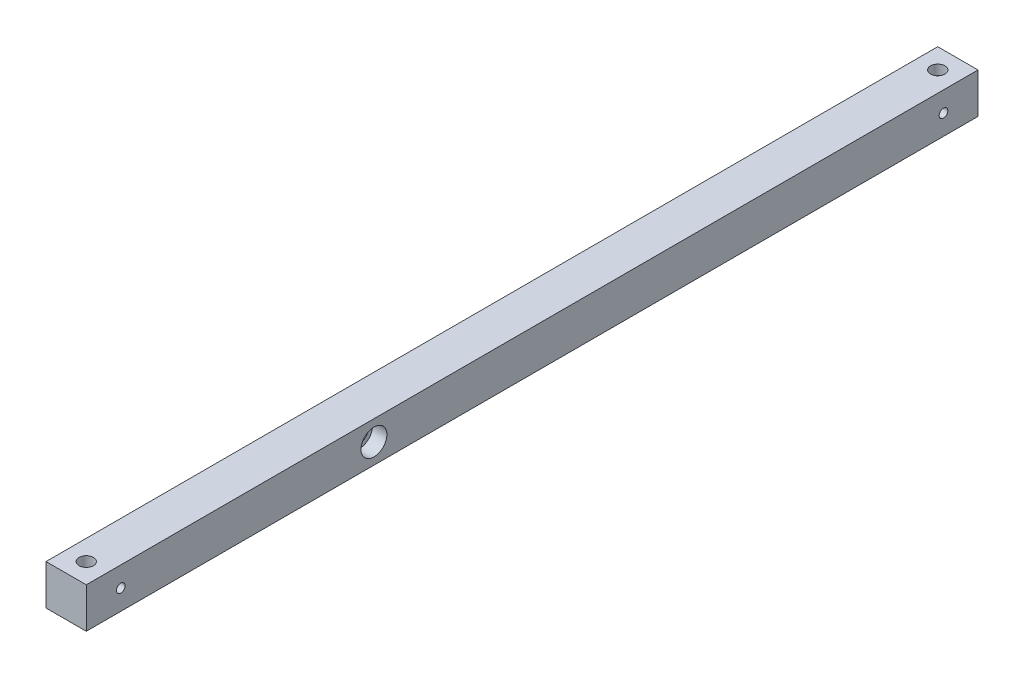
ISO-10303-21;
HEADER;
FILE_DESCRIPTION(('STEP AP214'),'2;1');
FILE_NAME('part.step','',(''),(''),'','','');
FILE_SCHEMA(('AUTOMOTIVE_DESIGN { 1 0 10303 214 1 1 1 1 }'));
ENDSEC;
DATA;
#1=APPLICATION_CONTEXT('core data for automotive mechanical design processes');
#2=APPLICATION_PROTOCOL_DEFINITION('international standard','automotive_design',2000,#1);
#3=PRODUCT_CONTEXT('',#1,'mechanical');
#4=PRODUCT('Part','Part','',(#3));
#5=PRODUCT_RELATED_PRODUCT_CATEGORY('part','',(#4));
#6=PRODUCT_DEFINITION_FORMATION('','',#4);
#7=PRODUCT_DEFINITION_CONTEXT('part definition',#1,'design');
#8=PRODUCT_DEFINITION('design','',#6,#7);
#9=PRODUCT_DEFINITION_SHAPE('','',#8);
#10=(LENGTH_UNIT() NAMED_UNIT(*) SI_UNIT(.MILLI.,.METRE.));
#11=(NAMED_UNIT(*) PLANE_ANGLE_UNIT() SI_UNIT($,.RADIAN.));
#12=(NAMED_UNIT(*) SI_UNIT($,.STERADIAN.) SOLID_ANGLE_UNIT());
#13=UNCERTAINTY_MEASURE_WITH_UNIT(LENGTH_MEASURE(1.E-05),#10,'distance_accuracy_value','');
#14=(GEOMETRIC_REPRESENTATION_CONTEXT(3) GLOBAL_UNCERTAINTY_ASSIGNED_CONTEXT((#13)) GLOBAL_UNIT_ASSIGNED_CONTEXT((#10,
#11,#12)) REPRESENTATION_CONTEXT('',''));
#15=CARTESIAN_POINT('',(0.,0.,0.));
#16=DIRECTION('',(0.,0.,1.));
#17=DIRECTION('',(1.,0.,0.));
#18=AXIS2_PLACEMENT_3D('',#15,#16,#17);
#19=CARTESIAN_POINT('',(-14.001,0.,596.));
#20=DIRECTION('',(1.,0.,0.));
#21=DIRECTION('',(0.,0.,-1.));
#22=AXIS2_PLACEMENT_3D('',#19,#20,#21);
#23=CYLINDRICAL_SURFACE('',#22,3.00000000000005);
#24=CARTESIAN_POINT('',(14.,0.,596.));
#25=DIRECTION('',(1.,0.,0.));
#26=DIRECTION('',(0.,0.,-1.));
#27=AXIS2_PLACEMENT_3D('',#24,#25,#26);
#28=CIRCLE('',#27,3.00000000000005);
#29=CARTESIAN_POINT('',(14.,0.,593.));
#30=VERTEX_POINT('',#29);
#31=EDGE_CURVE('E126',#30,#30,#28,.T.);
#32=ORIENTED_EDGE('',*,*,#31,.T.);
#33=EDGE_LOOP('',(#32));
#34=FACE_BOUND('',#33,.T.);
#35=CARTESIAN_POINT('',(-7.,0.,596.));
#36=DIRECTION('',(-1.,0.,0.));
#37=DIRECTION('',(0.,0.,1.));
#38=AXIS2_PLACEMENT_3D('',#35,#36,#37);
#39=CIRCLE('',#38,3.00000000000005);
#40=CARTESIAN_POINT('',(-7.,0.,599.));
#41=VERTEX_POINT('',#40);
#42=EDGE_CURVE('E36',#41,#41,#39,.F.);
#43=ORIENTED_EDGE('',*,*,#42,.F.);
#44=EDGE_LOOP('',(#43));
#45=FACE_BOUND('',#44,.T.);
#46=ADVANCED_FACE('F32',(#34,#45),#23,.F.);
#47=CARTESIAN_POINT('',(-14.001,0.,24.));
#48=DIRECTION('',(1.,0.,0.));
#49=DIRECTION('',(0.,0.,-1.));
#50=AXIS2_PLACEMENT_3D('',#47,#48,#49);
#51=CYLINDRICAL_SURFACE('',#50,3.);
#52=CARTESIAN_POINT('',(14.,0.,24.));
#53=DIRECTION('',(1.,0.,0.));
#54=DIRECTION('',(0.,0.,-1.));
#55=AXIS2_PLACEMENT_3D('',#52,#53,#54);
#56=CIRCLE('',#55,3.);
#57=CARTESIAN_POINT('',(14.,0.,21.));
#58=VERTEX_POINT('',#57);
#59=EDGE_CURVE('E141',#58,#58,#56,.T.);
#60=ORIENTED_EDGE('',*,*,#59,.T.);
#61=EDGE_LOOP('',(#60));
#62=FACE_BOUND('',#61,.T.);
#63=CARTESIAN_POINT('',(-7.,0.,24.));
#64=DIRECTION('',(-1.,0.,0.));
#65=DIRECTION('',(0.,0.,1.));
#66=AXIS2_PLACEMENT_3D('',#63,#64,#65);
#67=CIRCLE('',#66,3.);
#68=CARTESIAN_POINT('',(-7.,0.,27.));
#69=VERTEX_POINT('',#68);
#70=EDGE_CURVE('E120',#69,#69,#67,.F.);
#71=ORIENTED_EDGE('',*,*,#70,.F.);
#72=EDGE_LOOP('',(#71));
#73=FACE_BOUND('',#72,.T.);
#74=ADVANCED_FACE('F186',(#62,#73),#51,.F.);
#75=CARTESIAN_POINT('',(-14.,0.,420.));
#76=DIRECTION('',(1.,0.,0.));
#77=DIRECTION('',(0.,0.,-1.));
#78=AXIS2_PLACEMENT_3D('',#75,#76,#77);
#79=CYLINDRICAL_SURFACE('',#78,5.99999999999999);
#80=CARTESIAN_POINT('',(-14.,0.,420.));
#81=DIRECTION('',(1.,0.,0.));
#82=DIRECTION('',(0.,0.,-1.));
#83=AXIS2_PLACEMENT_3D('',#80,#81,#82);
#84=CIRCLE('',#83,5.99999999999999);
#85=CARTESIAN_POINT('',(-14.,0.,414.));
#86=VERTEX_POINT('',#85);
#87=EDGE_CURVE('E118',#86,#86,#84,.T.);
#88=ORIENTED_EDGE('',*,*,#87,.F.);
#89=EDGE_LOOP('',(#88));
#90=FACE_BOUND('',#89,.T.);
#91=CARTESIAN_POINT('',(4.,0.,420.));
#92=DIRECTION('',(1.,0.,0.));
#93=DIRECTION('',(0.,0.,-1.));
#94=AXIS2_PLACEMENT_3D('',#91,#92,#93);
#95=CIRCLE('',#94,5.99999999999999);
#96=CARTESIAN_POINT('',(4.,0.,414.));
#97=VERTEX_POINT('',#96);
#98=EDGE_CURVE('E116',#97,#97,#95,.F.);
#99=ORIENTED_EDGE('',*,*,#98,.F.);
#100=EDGE_LOOP('',(#99));
#101=FACE_BOUND('',#100,.T.);
#102=ADVANCED_FACE('F182',(#90,#101),#79,.F.);
#103=CARTESIAN_POINT('',(14.,-14.,620.));
#104=DIRECTION('',(-1.,0.,0.));
#105=DIRECTION('',(0.,0.,1.));
#106=AXIS2_PLACEMENT_3D('',#103,#104,#105);
#107=PLANE('',#106);
#108=ORIENTED_EDGE('',*,*,#59,.F.);
#109=EDGE_LOOP('',(#108));
#110=FACE_BOUND('',#109,.T.);
#111=ORIENTED_EDGE('',*,*,#31,.F.);
#112=EDGE_LOOP('',(#111));
#113=FACE_BOUND('',#112,.T.);
#114=CARTESIAN_POINT('',(14.,0.,420.));
#115=DIRECTION('',(1.,0.,0.));
#116=DIRECTION('',(0.,0.,-1.));
#117=AXIS2_PLACEMENT_3D('',#114,#115,#116);
#118=CIRCLE('',#117,8.99999999999998);
#119=CARTESIAN_POINT('',(14.,0.,411.));
#120=VERTEX_POINT('',#119);
#121=EDGE_CURVE('E144',#120,#120,#118,.T.);
#122=ORIENTED_EDGE('',*,*,#121,.F.);
#123=EDGE_LOOP('',(#122));
#124=FACE_BOUND('',#123,.T.);
#125=DIRECTION('',(0.,1.,0.));
#126=VECTOR('',#125,1.);
#127=CARTESIAN_POINT('',(14.,-14.,0.));
#128=LINE('',#127,#126);
#129=CARTESIAN_POINT('',(14.,-14.,0.));
#130=VERTEX_POINT('',#129);
#131=CARTESIAN_POINT('',(14.,14.,0.));
#132=VERTEX_POINT('',#131);
#133=EDGE_CURVE('E99',#130,#132,#128,.T.);
#134=ORIENTED_EDGE('',*,*,#133,.T.);
#135=DIRECTION('',(0.,0.,-1.));
#136=VECTOR('',#135,1.);
#137=CARTESIAN_POINT('',(14.,14.,620.));
#138=LINE('',#137,#136);
#139=CARTESIAN_POINT('',(14.,14.,620.));
#140=VERTEX_POINT('',#139);
#141=EDGE_CURVE('E11',#140,#132,#138,.T.);
#142=ORIENTED_EDGE('',*,*,#141,.F.);
#143=DIRECTION('',(0.,1.,0.));
#144=VECTOR('',#143,1.);
#145=CARTESIAN_POINT('',(14.,-14.,620.));
#146=LINE('',#145,#144);
#147=CARTESIAN_POINT('',(14.,-14.,620.));
#148=VERTEX_POINT('',#147);
#149=EDGE_CURVE('E86',#148,#140,#146,.T.);
#150=ORIENTED_EDGE('',*,*,#149,.F.);
#151=DIRECTION('',(0.,0.,-1.));
#152=VECTOR('',#151,1.);
#153=CARTESIAN_POINT('',(14.,-14.,620.));
#154=LINE('',#153,#152);
#155=EDGE_CURVE('E95',#148,#130,#154,.T.);
#156=ORIENTED_EDGE('',*,*,#155,.T.);
#157=EDGE_LOOP('',(#134,#142,#150,#156));
#158=FACE_BOUND('',#157,.T.);
#159=ADVANCED_FACE('F34',(#110,#113,#124,#158),#107,.F.);
#160=CARTESIAN_POINT('',(-14.,14.,620.));
#161=DIRECTION('',(0.,-1.,0.));
#162=DIRECTION('',(0.,0.,-1.));
#163=AXIS2_PLACEMENT_3D('',#160,#161,#162);
#164=PLANE('',#163);
#165=CARTESIAN_POINT('',(0.,14.,14.));
#166=DIRECTION('',(0.,1.,0.));
#167=DIRECTION('',(0.,0.,1.));
#168=AXIS2_PLACEMENT_3D('',#165,#166,#167);
#169=CIRCLE('',#168,5.);
#170=CARTESIAN_POINT('',(0.,14.,19.));
#171=VERTEX_POINT('',#170);
#172=EDGE_CURVE('E160',#171,#171,#169,.T.);
#173=ORIENTED_EDGE('',*,*,#172,.F.);
#174=EDGE_LOOP('',(#173));
#175=FACE_BOUND('',#174,.T.);
#176=CARTESIAN_POINT('',(0.,14.,606.));
#177=DIRECTION('',(0.,1.,0.));
#178=DIRECTION('',(0.,0.,1.));
#179=AXIS2_PLACEMENT_3D('',#176,#177,#178);
#180=CIRCLE('',#179,5.);
#181=CARTESIAN_POINT('',(0.,14.,611.));
#182=VERTEX_POINT('',#181);
#183=EDGE_CURVE('E115',#182,#182,#180,.T.);
#184=ORIENTED_EDGE('',*,*,#183,.F.);
#185=EDGE_LOOP('',(#184));
#186=FACE_BOUND('',#185,.T.);
#187=DIRECTION('',(-1.,0.,0.));
#188=VECTOR('',#187,1.);
#189=CARTESIAN_POINT('',(-14.,14.,0.));
#190=LINE('',#189,#188);
#191=CARTESIAN_POINT('',(-14.,14.,0.));
#192=VERTEX_POINT('',#191);
#193=EDGE_CURVE('E90',#132,#192,#190,.T.);
#194=ORIENTED_EDGE('',*,*,#193,.T.);
#195=DIRECTION('',(0.,0.,-1.));
#196=VECTOR('',#195,1.);
#197=CARTESIAN_POINT('',(-14.,14.,620.));
#198=LINE('',#197,#196);
#199=CARTESIAN_POINT('',(-14.,14.,620.));
#200=VERTEX_POINT('',#199);
#201=EDGE_CURVE('E42',#200,#192,#198,.T.);
#202=ORIENTED_EDGE('',*,*,#201,.F.);
#203=DIRECTION('',(-1.,0.,0.));
#204=VECTOR('',#203,1.);
#205=CARTESIAN_POINT('',(-14.,14.,620.));
#206=LINE('',#205,#204);
#207=EDGE_CURVE('E81',#140,#200,#206,.T.);
#208=ORIENTED_EDGE('',*,*,#207,.F.);
#209=ORIENTED_EDGE('',*,*,#141,.T.);
#210=EDGE_LOOP('',(#194,#202,#208,#209));
#211=FACE_BOUND('',#210,.T.);
#212=ADVANCED_FACE('F89',(#175,#186,#211),#164,.F.);
#213=CARTESIAN_POINT('',(-14.,-14.,620.));
#214=DIRECTION('',(1.,0.,0.));
#215=DIRECTION('',(0.,0.,-1.));
#216=AXIS2_PLACEMENT_3D('',#213,#214,#215);
#217=PLANE('',#216);
#218=CARTESIAN_POINT('',(-14.,0.,596.));
#219=DIRECTION('',(-1.,0.,0.));
#220=DIRECTION('',(0.,0.,1.));
#221=AXIS2_PLACEMENT_3D('',#218,#219,#220);
#222=CIRCLE('',#221,5.00000000000004);
#223=CARTESIAN_POINT('',(-14.,0.,601.));
#224=VERTEX_POINT('',#223);
#225=EDGE_CURVE('E128',#224,#224,#222,.T.);
#226=ORIENTED_EDGE('',*,*,#225,.F.);
#227=EDGE_LOOP('',(#226));
#228=FACE_BOUND('',#227,.T.);
#229=CARTESIAN_POINT('',(-14.,0.,24.));
#230=DIRECTION('',(-1.,0.,0.));
#231=DIRECTION('',(0.,0.,1.));
#232=AXIS2_PLACEMENT_3D('',#229,#230,#231);
#233=CIRCLE('',#232,5.);
#234=CARTESIAN_POINT('',(-14.,0.,29.));
#235=VERTEX_POINT('',#234);
#236=EDGE_CURVE('E138',#235,#235,#233,.T.);
#237=ORIENTED_EDGE('',*,*,#236,.F.);
#238=EDGE_LOOP('',(#237));
#239=FACE_BOUND('',#238,.T.);
#240=ORIENTED_EDGE('',*,*,#87,.T.);
#241=EDGE_LOOP('',(#240));
#242=FACE_BOUND('',#241,.T.);
#243=DIRECTION('',(0.,-1.,0.));
#244=VECTOR('',#243,1.);
#245=CARTESIAN_POINT('',(-14.,-14.,0.));
#246=LINE('',#245,#244);
#247=CARTESIAN_POINT('',(-14.,-14.,0.));
#248=VERTEX_POINT('',#247);
#249=EDGE_CURVE('E68',#192,#248,#246,.T.);
#250=ORIENTED_EDGE('',*,*,#249,.T.);
#251=DIRECTION('',(0.,0.,-1.));
#252=VECTOR('',#251,1.);
#253=CARTESIAN_POINT('',(-14.,-14.,620.));
#254=LINE('',#253,#252);
#255=CARTESIAN_POINT('',(-14.,-14.,620.));
#256=VERTEX_POINT('',#255);
#257=EDGE_CURVE('E91',#256,#248,#254,.T.);
#258=ORIENTED_EDGE('',*,*,#257,.F.);
#259=DIRECTION('',(0.,-1.,0.));
#260=VECTOR('',#259,1.);
#261=CARTESIAN_POINT('',(-14.,-14.,620.));
#262=LINE('',#261,#260);
#263=EDGE_CURVE('E84',#200,#256,#262,.T.);
#264=ORIENTED_EDGE('',*,*,#263,.F.);
#265=ORIENTED_EDGE('',*,*,#201,.T.);
#266=EDGE_LOOP('',(#250,#258,#264,#265));
#267=FACE_BOUND('',#266,.T.);
#268=ADVANCED_FACE('F93',(#228,#239,#242,#267),#217,.F.);
#269=CARTESIAN_POINT('',(-14.,-14.,620.));
#270=DIRECTION('',(0.,1.,0.));
#271=DIRECTION('',(0.,0.,1.));
#272=AXIS2_PLACEMENT_3D('',#269,#270,#271);
#273=PLANE('',#272);
#274=CARTESIAN_POINT('',(0.,-14.,606.));
#275=DIRECTION('',(0.,1.,0.));
#276=DIRECTION('',(0.,0.,1.));
#277=AXIS2_PLACEMENT_3D('',#274,#275,#276);
#278=CIRCLE('',#277,3.);
#279=CARTESIAN_POINT('',(0.,-14.,609.));
#280=VERTEX_POINT('',#279);
#281=EDGE_CURVE('E112',#280,#280,#278,.T.);
#282=ORIENTED_EDGE('',*,*,#281,.T.);
#283=EDGE_LOOP('',(#282));
#284=FACE_BOUND('',#283,.T.);
#285=CARTESIAN_POINT('',(0.,-14.,14.));
#286=DIRECTION('',(0.,1.,0.));
#287=DIRECTION('',(0.,0.,1.));
#288=AXIS2_PLACEMENT_3D('',#285,#286,#287);
#289=CIRCLE('',#288,3.);
#290=CARTESIAN_POINT('',(0.,-14.,17.));
#291=VERTEX_POINT('',#290);
#292=EDGE_CURVE('E153',#291,#291,#289,.T.);
#293=ORIENTED_EDGE('',*,*,#292,.T.);
#294=EDGE_LOOP('',(#293));
#295=FACE_BOUND('',#294,.T.);
#296=DIRECTION('',(1.,0.,0.));
#297=VECTOR('',#296,1.);
#298=CARTESIAN_POINT('',(-14.,-14.,0.));
#299=LINE('',#298,#297);
#300=EDGE_CURVE('E74',#248,#130,#299,.T.);
#301=ORIENTED_EDGE('',*,*,#300,.T.);
#302=ORIENTED_EDGE('',*,*,#155,.F.);
#303=DIRECTION('',(1.,0.,0.));
#304=VECTOR('',#303,1.);
#305=CARTESIAN_POINT('',(-14.,-14.,620.));
#306=LINE('',#305,#304);
#307=EDGE_CURVE('E51',#256,#148,#306,.T.);
#308=ORIENTED_EDGE('',*,*,#307,.F.);
#309=ORIENTED_EDGE('',*,*,#257,.T.);
#310=EDGE_LOOP('',(#301,#302,#308,#309));
#311=FACE_BOUND('',#310,.T.);
#312=ADVANCED_FACE('F178',(#284,#295,#311),#273,.F.);
#313=CARTESIAN_POINT('',(0.,0.,620.));
#314=DIRECTION('',(0.,0.,-1.));
#315=DIRECTION('',(-1.,0.,0.));
#316=AXIS2_PLACEMENT_3D('',#313,#314,#315);
#317=PLANE('',#316);
#318=ORIENTED_EDGE('',*,*,#149,.T.);
#319=ORIENTED_EDGE('',*,*,#207,.T.);
#320=ORIENTED_EDGE('',*,*,#263,.T.);
#321=ORIENTED_EDGE('',*,*,#307,.T.);
#322=EDGE_LOOP('',(#318,#319,#320,#321));
#323=FACE_BOUND('',#322,.T.);
#324=ADVANCED_FACE('F82',(#323),#317,.F.);
#325=CARTESIAN_POINT('',(0.,0.,0.));
#326=DIRECTION('',(0.,0.,-1.));
#327=DIRECTION('',(-1.,0.,0.));
#328=AXIS2_PLACEMENT_3D('',#325,#326,#327);
#329=PLANE('',#328);
#330=ORIENTED_EDGE('',*,*,#133,.F.);
#331=ORIENTED_EDGE('',*,*,#300,.F.);
#332=ORIENTED_EDGE('',*,*,#249,.F.);
#333=ORIENTED_EDGE('',*,*,#193,.F.);
#334=EDGE_LOOP('',(#330,#331,#332,#333));
#335=FACE_BOUND('',#334,.T.);
#336=ADVANCED_FACE('F231',(#335),#329,.T.);
#337=CARTESIAN_POINT('',(0.,7.,606.));
#338=DIRECTION('',(0.,1.,0.));
#339=DIRECTION('',(0.,0.,1.));
#340=AXIS2_PLACEMENT_3D('',#337,#338,#339);
#341=CYLINDRICAL_SURFACE('',#340,5.);
#342=CARTESIAN_POINT('',(0.,7.,606.));
#343=DIRECTION('',(0.,1.,0.));
#344=DIRECTION('',(0.,0.,1.));
#345=AXIS2_PLACEMENT_3D('',#342,#343,#344);
#346=CIRCLE('',#345,5.);
#347=CARTESIAN_POINT('',(0.,7.,611.));
#348=VERTEX_POINT('',#347);
#349=EDGE_CURVE('E163',#348,#348,#346,.T.);
#350=ORIENTED_EDGE('',*,*,#349,.F.);
#351=EDGE_LOOP('',(#350));
#352=FACE_BOUND('',#351,.T.);
#353=ORIENTED_EDGE('',*,*,#183,.T.);
#354=EDGE_LOOP('',(#353));
#355=FACE_BOUND('',#354,.T.);
#356=ADVANCED_FACE('F169',(#352,#355),#341,.F.);
#357=CARTESIAN_POINT('',(0.,7.,606.));
#358=DIRECTION('',(0.,1.,0.));
#359=DIRECTION('',(0.,0.,1.));
#360=AXIS2_PLACEMENT_3D('',#357,#358,#359);
#361=PLANE('',#360);
#362=CARTESIAN_POINT('',(0.,7.,606.));
#363=DIRECTION('',(0.,1.,0.));
#364=DIRECTION('',(0.,0.,1.));
#365=AXIS2_PLACEMENT_3D('',#362,#363,#364);
#366=CIRCLE('',#365,3.);
#367=CARTESIAN_POINT('',(0.,7.,609.));
#368=VERTEX_POINT('',#367);
#369=EDGE_CURVE('E111',#368,#368,#366,.T.);
#370=ORIENTED_EDGE('',*,*,#369,.F.);
#371=EDGE_LOOP('',(#370));
#372=FACE_BOUND('',#371,.T.);
#373=ORIENTED_EDGE('',*,*,#349,.T.);
#374=EDGE_LOOP('',(#373));
#375=FACE_BOUND('',#374,.T.);
#376=ADVANCED_FACE('F224',(#372,#375),#361,.T.);
#377=CARTESIAN_POINT('',(0.,7.,14.));
#378=DIRECTION('',(0.,1.,0.));
#379=DIRECTION('',(0.,0.,1.));
#380=AXIS2_PLACEMENT_3D('',#377,#378,#379);
#381=CYLINDRICAL_SURFACE('',#380,5.);
#382=CARTESIAN_POINT('',(0.,7.,14.));
#383=DIRECTION('',(0.,1.,0.));
#384=DIRECTION('',(0.,0.,1.));
#385=AXIS2_PLACEMENT_3D('',#382,#383,#384);
#386=CIRCLE('',#385,5.);
#387=CARTESIAN_POINT('',(0.,7.,19.));
#388=VERTEX_POINT('',#387);
#389=EDGE_CURVE('E102',#388,#388,#386,.T.);
#390=ORIENTED_EDGE('',*,*,#389,.F.);
#391=EDGE_LOOP('',(#390));
#392=FACE_BOUND('',#391,.T.);
#393=ORIENTED_EDGE('',*,*,#172,.T.);
#394=EDGE_LOOP('',(#393));
#395=FACE_BOUND('',#394,.T.);
#396=ADVANCED_FACE('F220',(#392,#395),#381,.F.);
#397=CARTESIAN_POINT('',(0.,7.,14.));
#398=DIRECTION('',(0.,1.,0.));
#399=DIRECTION('',(0.,0.,1.));
#400=AXIS2_PLACEMENT_3D('',#397,#398,#399);
#401=PLANE('',#400);
#402=CARTESIAN_POINT('',(0.,7.,14.));
#403=DIRECTION('',(0.,1.,0.));
#404=DIRECTION('',(0.,0.,1.));
#405=AXIS2_PLACEMENT_3D('',#402,#403,#404);
#406=CIRCLE('',#405,3.);
#407=CARTESIAN_POINT('',(0.,7.,17.));
#408=VERTEX_POINT('',#407);
#409=EDGE_CURVE('E108',#408,#408,#406,.T.);
#410=ORIENTED_EDGE('',*,*,#409,.F.);
#411=EDGE_LOOP('',(#410));
#412=FACE_BOUND('',#411,.T.);
#413=ORIENTED_EDGE('',*,*,#389,.T.);
#414=EDGE_LOOP('',(#413));
#415=FACE_BOUND('',#414,.T.);
#416=ADVANCED_FACE('F216',(#412,#415),#401,.T.);
#417=CARTESIAN_POINT('',(0.,-14.,14.));
#418=DIRECTION('',(0.,1.,0.));
#419=DIRECTION('',(0.,0.,1.));
#420=AXIS2_PLACEMENT_3D('',#417,#418,#419);
#421=CYLINDRICAL_SURFACE('',#420,3.);
#422=ORIENTED_EDGE('',*,*,#409,.T.);
#423=EDGE_LOOP('',(#422));
#424=FACE_BOUND('',#423,.T.);
#425=ORIENTED_EDGE('',*,*,#292,.F.);
#426=EDGE_LOOP('',(#425));
#427=FACE_BOUND('',#426,.T.);
#428=ADVANCED_FACE('F212',(#424,#427),#421,.F.);
#429=CARTESIAN_POINT('',(0.,-14.,606.));
#430=DIRECTION('',(0.,1.,0.));
#431=DIRECTION('',(0.,0.,1.));
#432=AXIS2_PLACEMENT_3D('',#429,#430,#431);
#433=CYLINDRICAL_SURFACE('',#432,3.);
#434=ORIENTED_EDGE('',*,*,#369,.T.);
#435=EDGE_LOOP('',(#434));
#436=FACE_BOUND('',#435,.T.);
#437=ORIENTED_EDGE('',*,*,#281,.F.);
#438=EDGE_LOOP('',(#437));
#439=FACE_BOUND('',#438,.T.);
#440=ADVANCED_FACE('F202',(#436,#439),#433,.F.);
#441=CARTESIAN_POINT('',(4.,0.,420.));
#442=DIRECTION('',(1.,0.,0.));
#443=DIRECTION('',(0.,0.,-1.));
#444=AXIS2_PLACEMENT_3D('',#441,#442,#443);
#445=PLANE('',#444);
#446=CARTESIAN_POINT('',(4.,0.,420.));
#447=DIRECTION('',(1.,0.,0.));
#448=DIRECTION('',(0.,0.,-1.));
#449=AXIS2_PLACEMENT_3D('',#446,#447,#448);
#450=CIRCLE('',#449,8.99999999999998);
#451=CARTESIAN_POINT('',(4.,0.,411.));
#452=VERTEX_POINT('',#451);
#453=EDGE_CURVE('E119',#452,#452,#450,.T.);
#454=ORIENTED_EDGE('',*,*,#453,.T.);
#455=EDGE_LOOP('',(#454));
#456=FACE_BOUND('',#455,.T.);
#457=ORIENTED_EDGE('',*,*,#98,.T.);
#458=EDGE_LOOP('',(#457));
#459=FACE_BOUND('',#458,.T.);
#460=ADVANCED_FACE('F198',(#456,#459),#445,.T.);
#461=CARTESIAN_POINT('',(4.,0.,420.));
#462=DIRECTION('',(1.,0.,0.));
#463=DIRECTION('',(0.,0.,-1.));
#464=AXIS2_PLACEMENT_3D('',#461,#462,#463);
#465=CYLINDRICAL_SURFACE('',#464,8.99999999999998);
#466=ORIENTED_EDGE('',*,*,#453,.F.);
#467=EDGE_LOOP('',(#466));
#468=FACE_BOUND('',#467,.T.);
#469=ORIENTED_EDGE('',*,*,#121,.T.);
#470=EDGE_LOOP('',(#469));
#471=FACE_BOUND('',#470,.T.);
#472=ADVANCED_FACE('F201',(#468,#471),#465,.F.);
#473=CARTESIAN_POINT('',(-7.,0.,24.));
#474=DIRECTION('',(-1.,0.,0.));
#475=DIRECTION('',(0.,0.,1.));
#476=AXIS2_PLACEMENT_3D('',#473,#474,#475);
#477=PLANE('',#476);
#478=CARTESIAN_POINT('',(-7.,0.,24.));
#479=DIRECTION('',(-1.,0.,0.));
#480=DIRECTION('',(0.,0.,1.));
#481=AXIS2_PLACEMENT_3D('',#478,#479,#480);
#482=CIRCLE('',#481,5.);
#483=CARTESIAN_POINT('',(-7.,0.,29.));
#484=VERTEX_POINT('',#483);
#485=EDGE_CURVE('E133',#484,#484,#482,.T.);
#486=ORIENTED_EDGE('',*,*,#485,.T.);
#487=EDGE_LOOP('',(#486));
#488=FACE_BOUND('',#487,.T.);
#489=ORIENTED_EDGE('',*,*,#70,.T.);
#490=EDGE_LOOP('',(#489));
#491=FACE_BOUND('',#490,.T.);
#492=ADVANCED_FACE('F205',(#488,#491),#477,.T.);
#493=CARTESIAN_POINT('',(-7.,0.,24.));
#494=DIRECTION('',(-1.,0.,0.));
#495=DIRECTION('',(0.,0.,1.));
#496=AXIS2_PLACEMENT_3D('',#493,#494,#495);
#497=CYLINDRICAL_SURFACE('',#496,5.);
#498=ORIENTED_EDGE('',*,*,#485,.F.);
#499=EDGE_LOOP('',(#498));
#500=FACE_BOUND('',#499,.T.);
#501=ORIENTED_EDGE('',*,*,#236,.T.);
#502=EDGE_LOOP('',(#501));
#503=FACE_BOUND('',#502,.T.);
#504=ADVANCED_FACE('F312',(#500,#503),#497,.F.);
#505=CARTESIAN_POINT('',(-7.,0.,596.));
#506=DIRECTION('',(-1.,0.,0.));
#507=DIRECTION('',(0.,0.,1.));
#508=AXIS2_PLACEMENT_3D('',#505,#506,#507);
#509=PLANE('',#508);
#510=CARTESIAN_POINT('',(-7.,0.,596.));
#511=DIRECTION('',(-1.,0.,0.));
#512=DIRECTION('',(0.,0.,1.));
#513=AXIS2_PLACEMENT_3D('',#510,#511,#512);
#514=CIRCLE('',#513,5.00000000000004);
#515=CARTESIAN_POINT('',(-7.,0.,601.));
#516=VERTEX_POINT('',#515);
#517=EDGE_CURVE('E122',#516,#516,#514,.T.);
#518=ORIENTED_EDGE('',*,*,#517,.T.);
#519=EDGE_LOOP('',(#518));
#520=FACE_BOUND('',#519,.T.);
#521=ORIENTED_EDGE('',*,*,#42,.T.);
#522=EDGE_LOOP('',(#521));
#523=FACE_BOUND('',#522,.T.);
#524=ADVANCED_FACE('F322',(#520,#523),#509,.T.);
#525=CARTESIAN_POINT('',(-7.,0.,596.));
#526=DIRECTION('',(-1.,0.,0.));
#527=DIRECTION('',(0.,0.,1.));
#528=AXIS2_PLACEMENT_3D('',#525,#526,#527);
#529=CYLINDRICAL_SURFACE('',#528,5.00000000000004);
#530=ORIENTED_EDGE('',*,*,#517,.F.);
#531=EDGE_LOOP('',(#530));
#532=FACE_BOUND('',#531,.T.);
#533=ORIENTED_EDGE('',*,*,#225,.T.);
#534=EDGE_LOOP('',(#533));
#535=FACE_BOUND('',#534,.T.);
#536=ADVANCED_FACE('F331',(#532,#535),#529,.F.);
#537=CLOSED_SHELL('',(#46,#74,#102,#159,#212,#268,#312,#324,#336,#356,#376,#396,#416,#428,#440,
#460,#472,#492,#504,#524,#536));
#538=MANIFOLD_SOLID_BREP('B2',#537);
#539=ADVANCED_BREP_SHAPE_REPRESENTATION('',(#18,#538),#14);
#540=SHAPE_DEFINITION_REPRESENTATION(#9,#539);
ENDSEC;
END-ISO-10303-21;
